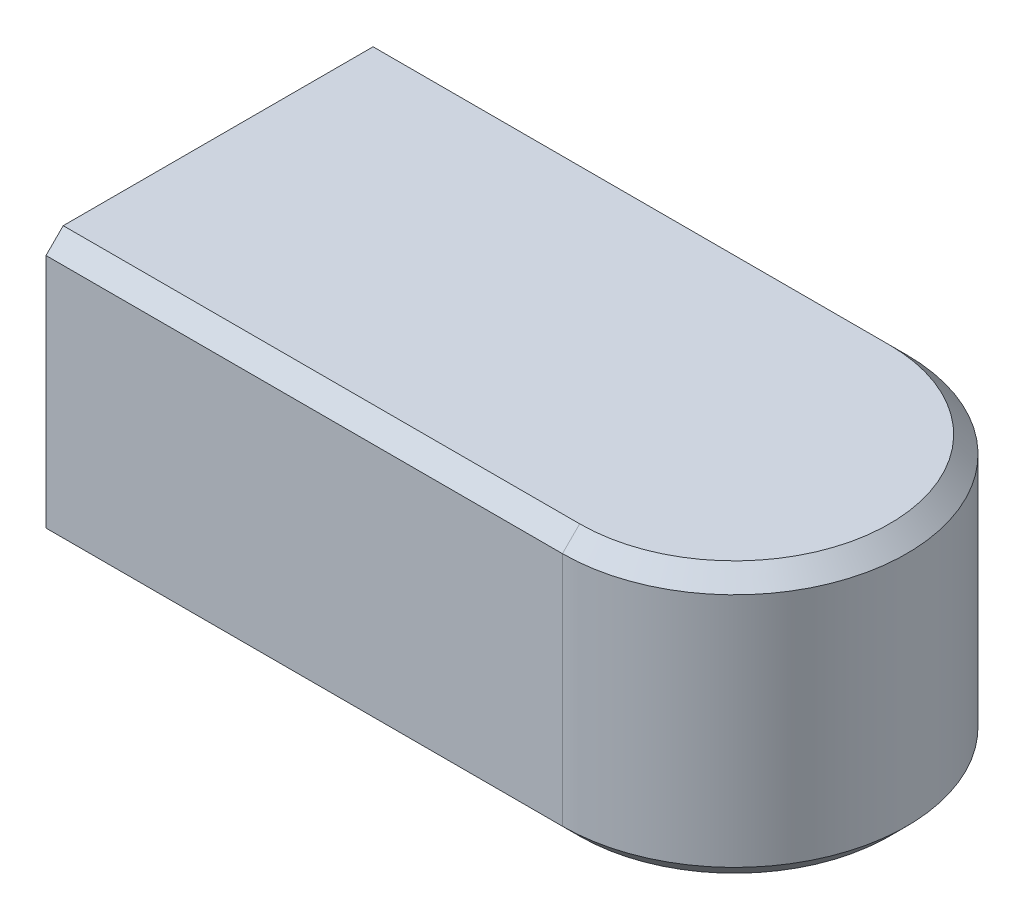
ISO-10303-21;
HEADER;
FILE_DESCRIPTION(('STEP AP214'),'2;1');
FILE_NAME('part.step','',(''),(''),'','','');
FILE_SCHEMA(('AUTOMOTIVE_DESIGN { 1 0 10303 214 1 1 1 1 }'));
ENDSEC;
DATA;
#1=APPLICATION_CONTEXT('core data for automotive mechanical design processes');
#2=APPLICATION_PROTOCOL_DEFINITION('international standard','automotive_design',2000,#1);
#3=PRODUCT_CONTEXT('',#1,'mechanical');
#4=PRODUCT('Part','Part','',(#3));
#5=PRODUCT_RELATED_PRODUCT_CATEGORY('part','',(#4));
#6=PRODUCT_DEFINITION_FORMATION('','',#4);
#7=PRODUCT_DEFINITION_CONTEXT('part definition',#1,'design');
#8=PRODUCT_DEFINITION('design','',#6,#7);
#9=PRODUCT_DEFINITION_SHAPE('','',#8);
#10=(LENGTH_UNIT() NAMED_UNIT(*) SI_UNIT(.MILLI.,.METRE.));
#11=(NAMED_UNIT(*) PLANE_ANGLE_UNIT() SI_UNIT($,.RADIAN.));
#12=(NAMED_UNIT(*) SI_UNIT($,.STERADIAN.) SOLID_ANGLE_UNIT());
#13=UNCERTAINTY_MEASURE_WITH_UNIT(LENGTH_MEASURE(1.E-05),#10,'distance_accuracy_value','');
#14=(GEOMETRIC_REPRESENTATION_CONTEXT(3) GLOBAL_UNCERTAINTY_ASSIGNED_CONTEXT((#13)) GLOBAL_UNIT_ASSIGNED_CONTEXT((#10,
#11,#12)) REPRESENTATION_CONTEXT('',''));
#15=CARTESIAN_POINT('',(0.,0.,0.));
#16=DIRECTION('',(0.,0.,1.));
#17=DIRECTION('',(1.,0.,0.));
#18=AXIS2_PLACEMENT_3D('',#15,#16,#17);
#19=CARTESIAN_POINT('',(-10.5,10.6499999999999,6.64999999999993));
#20=DIRECTION('',(0.,0.70710678118655,0.70710678118655));
#21=DIRECTION('',(0.,-0.70710678118655,0.70710678118655));
#22=AXIS2_PLACEMENT_3D('',#19,#20,#21);
#23=PLANE('',#22);
#24=DIRECTION('',(1.,0.,0.));
#25=VECTOR('',#24,1.);
#26=CARTESIAN_POINT('',(0.,11.,6.29999999999997));
#27=LINE('',#26,#25);
#28=CARTESIAN_POINT('',(-21.,11.,6.29999999999997));
#29=VERTEX_POINT('',#28);
#30=CARTESIAN_POINT('',(0.,11.0000009966028,6.30000049829438));
#31=VERTEX_POINT('',#30);
#32=EDGE_CURVE('E77',#29,#31,#27,.T.);
#33=ORIENTED_EDGE('',*,*,#32,.F.);
#34=DIRECTION('',(0.,-0.70710678118655,0.70710678118655));
#35=VECTOR('',#34,1.);
#36=CARTESIAN_POINT('',(-21.,10.6499999999999,6.64999999999993));
#37=LINE('',#36,#35);
#38=CARTESIAN_POINT('',(-21.,10.2999999999999,6.99999999999978));
#39=VERTEX_POINT('',#38);
#40=EDGE_CURVE('E160',#29,#39,#37,.T.);
#41=ORIENTED_EDGE('',*,*,#40,.T.);
#42=DIRECTION('',(1.,0.,0.));
#43=VECTOR('',#42,1.);
#44=CARTESIAN_POINT('',(-21.,10.2999999999999,6.99999999999978));
#45=LINE('',#44,#43);
#46=CARTESIAN_POINT('',(0.,10.3000002768205,7.00000027682868));
#47=VERTEX_POINT('',#46);
#48=EDGE_CURVE('E110',#47,#39,#45,.F.);
#49=ORIENTED_EDGE('',*,*,#48,.F.);
#50=DIRECTION('',(0.,0.707106669334586,-0.707106893038496));
#51=VECTOR('',#50,1.);
#52=CARTESIAN_POINT('',(-2.70866662432923E-10,-498982.542133841,499000.000000003));
#53=LINE('',#52,#51);
#54=EDGE_CURVE('E96',#31,#47,#53,.F.);
#55=ORIENTED_EDGE('',*,*,#54,.F.);
#56=EDGE_LOOP('',(#33,#41,#49,#55));
#57=FACE_BOUND('',#56,.T.);
#58=ADVANCED_FACE('F16',(#57),#23,.T.);
#59=CARTESIAN_POINT('',(0.,10.3000011072821,-1.11022302462516E-13));
#60=DIRECTION('',(0.,-1.,0.));
#61=DIRECTION('',(0.,0.,-1.));
#62=AXIS2_PLACEMENT_3D('',#59,#60,#61);
#63=CONICAL_SURFACE('',#62,7.0000011073148,0.78539832154396);
#64=DIRECTION('',(0.,0.70710678118655,0.70710678118655));
#65=VECTOR('',#64,1.);
#66=CARTESIAN_POINT('',(0.,10.6499999999999,-6.65000000000027));
#67=LINE('',#66,#65);
#68=CARTESIAN_POINT('',(0.,11.0000004983012,-6.30000049829482));
#69=VERTEX_POINT('',#68);
#70=CARTESIAN_POINT('',(0.,10.2999999999998,-7.00000000000034));
#71=VERTEX_POINT('',#70);
#72=EDGE_CURVE('E88',#69,#71,#67,.F.);
#73=ORIENTED_EDGE('',*,*,#72,.F.);
#74=CARTESIAN_POINT('',(0.,11.0000009966027,-2.22044604925031E-13));
#75=DIRECTION('',(0.,-1.,0.));
#76=DIRECTION('',(0.,0.,-1.));
#77=AXIS2_PLACEMENT_3D('',#74,#75,#76);
#78=CIRCLE('',#77,6.30000099658901);
#79=EDGE_CURVE('E19',#31,#69,#78,.F.);
#80=ORIENTED_EDGE('',*,*,#79,.F.);
#81=ORIENTED_EDGE('',*,*,#54,.T.);
#82=CARTESIAN_POINT('',(0.,10.3,0.));
#83=DIRECTION('',(0.,1.,0.));
#84=DIRECTION('',(0.,0.,1.));
#85=AXIS2_PLACEMENT_3D('',#82,#83,#84);
#86=CIRCLE('',#85,7.);
#87=EDGE_CURVE('E91',#71,#47,#86,.F.);
#88=ORIENTED_EDGE('',*,*,#87,.F.);
#89=EDGE_LOOP('',(#73,#80,#81,#88));
#90=FACE_BOUND('',#89,.T.);
#91=ADVANCED_FACE('F89',(#90),#63,.T.);
#92=CARTESIAN_POINT('',(-10.5,10.6499999999999,-6.65000000000027));
#93=DIRECTION('',(0.,0.70710678118655,-0.70710678118655));
#94=DIRECTION('',(0.,0.70710678118655,0.70710678118655));
#95=AXIS2_PLACEMENT_3D('',#92,#93,#94);
#96=PLANE('',#95);
#97=DIRECTION('',(-1.,0.,0.));
#98=VECTOR('',#97,1.);
#99=CARTESIAN_POINT('',(0.,10.2999999999998,-7.00000000000034));
#100=LINE('',#99,#98);
#101=CARTESIAN_POINT('',(-21.,10.2999999999998,-7.00000000000034));
#102=VERTEX_POINT('',#101);
#103=EDGE_CURVE('E133',#102,#71,#100,.F.);
#104=ORIENTED_EDGE('',*,*,#103,.F.);
#105=DIRECTION('',(0.,0.70710678118655,0.70710678118655));
#106=VECTOR('',#105,1.);
#107=CARTESIAN_POINT('',(-21.,10.6499999999999,-6.65000000000027));
#108=LINE('',#107,#106);
#109=CARTESIAN_POINT('',(-21.,11.,-6.30000000000008));
#110=VERTEX_POINT('',#109);
#111=EDGE_CURVE('E95',#102,#110,#108,.T.);
#112=ORIENTED_EDGE('',*,*,#111,.T.);
#113=DIRECTION('',(1.,0.,0.));
#114=VECTOR('',#113,1.);
#115=CARTESIAN_POINT('',(0.,11.,-6.30000000000008));
#116=LINE('',#115,#114);
#117=EDGE_CURVE('E84',#69,#110,#116,.F.);
#118=ORIENTED_EDGE('',*,*,#117,.F.);
#119=ORIENTED_EDGE('',*,*,#72,.T.);
#120=EDGE_LOOP('',(#104,#112,#118,#119));
#121=FACE_BOUND('',#120,.T.);
#122=ADVANCED_FACE('F98',(#121),#96,.T.);
#123=CARTESIAN_POINT('',(0.,0.,0.));
#124=DIRECTION('',(0.,1.,0.));
#125=DIRECTION('',(0.,0.,1.));
#126=AXIS2_PLACEMENT_3D('',#123,#124,#125);
#127=CYLINDRICAL_SURFACE('',#126,7.);
#128=DIRECTION('',(0.,1.,0.));
#129=VECTOR('',#128,1.);
#130=CARTESIAN_POINT('',(0.,-3.33066907387547E-13,-7.00000000000039));
#131=LINE('',#130,#129);
#132=CARTESIAN_POINT('',(0.,0.699999723170946,-7.00000027682901));
#133=VERTEX_POINT('',#132);
#134=EDGE_CURVE('E136',#71,#133,#131,.F.);
#135=ORIENTED_EDGE('',*,*,#134,.F.);
#136=ORIENTED_EDGE('',*,*,#87,.T.);
#137=DIRECTION('',(0.,1.,0.));
#138=VECTOR('',#137,1.);
#139=CARTESIAN_POINT('',(0.,-5.27355936696949E-13,6.99999999999951));
#140=LINE('',#139,#138);
#141=CARTESIAN_POINT('',(0.,0.699999446328148,7.00000055364314));
#142=VERTEX_POINT('',#141);
#143=EDGE_CURVE('E135',#142,#47,#140,.T.);
#144=ORIENTED_EDGE('',*,*,#143,.F.);
#145=CARTESIAN_POINT('',(0.,0.699998892684989,0.));
#146=DIRECTION('',(0.,1.,0.));
#147=DIRECTION('',(-1.,0.,2.47234416787478E-10));
#148=AXIS2_PLACEMENT_3D('',#145,#146,#147);
#149=CIRCLE('',#148,7.0000011073148);
#150=EDGE_CURVE('E101',#133,#142,#149,.F.);
#151=ORIENTED_EDGE('',*,*,#150,.F.);
#152=EDGE_LOOP('',(#135,#136,#144,#151));
#153=FACE_BOUND('',#152,.T.);
#154=ADVANCED_FACE('F241',(#153),#127,.T.);
#155=CARTESIAN_POINT('',(0.,-3.33066907387547E-13,-7.00000000000039));
#156=DIRECTION('',(0.,0.,-1.));
#157=DIRECTION('',(-1.,0.,0.));
#158=AXIS2_PLACEMENT_3D('',#155,#156,#157);
#159=PLANE('',#158);
#160=DIRECTION('',(0.,1.,0.));
#161=VECTOR('',#160,1.);
#162=CARTESIAN_POINT('',(-21.,-3.33066907387547E-13,-7.00000000000039));
#163=LINE('',#162,#161);
#164=CARTESIAN_POINT('',(-21.,0.699999999999562,-7.00000000000045));
#165=VERTEX_POINT('',#164);
#166=EDGE_CURVE('E129',#102,#165,#163,.F.);
#167=ORIENTED_EDGE('',*,*,#166,.F.);
#168=ORIENTED_EDGE('',*,*,#103,.T.);
#169=ORIENTED_EDGE('',*,*,#134,.T.);
#170=DIRECTION('',(1.,0.,0.));
#171=VECTOR('',#170,1.);
#172=CARTESIAN_POINT('',(-10.5,0.699999999999562,-7.00000000000045));
#173=LINE('',#172,#171);
#174=EDGE_CURVE('E122',#165,#133,#173,.T.);
#175=ORIENTED_EDGE('',*,*,#174,.F.);
#176=EDGE_LOOP('',(#167,#168,#169,#175));
#177=FACE_BOUND('',#176,.T.);
#178=ADVANCED_FACE('F212',(#177),#159,.T.);
#179=CARTESIAN_POINT('',(-21.,-5.27355936696949E-13,6.99999999999951));
#180=DIRECTION('',(0.,0.,1.));
#181=DIRECTION('',(1.,0.,0.));
#182=AXIS2_PLACEMENT_3D('',#179,#180,#181);
#183=PLANE('',#182);
#184=ORIENTED_EDGE('',*,*,#143,.T.);
#185=ORIENTED_EDGE('',*,*,#48,.T.);
#186=DIRECTION('',(0.,1.,0.));
#187=VECTOR('',#186,1.);
#188=CARTESIAN_POINT('',(-21.,-5.27355936696949E-13,6.99999999999951));
#189=LINE('',#188,#187);
#190=CARTESIAN_POINT('',(-21.,0.699999999999978,6.9999999999999));
#191=VERTEX_POINT('',#190);
#192=EDGE_CURVE('E115',#191,#39,#189,.T.);
#193=ORIENTED_EDGE('',*,*,#192,.F.);
#194=DIRECTION('',(1.,0.,0.));
#195=VECTOR('',#194,1.);
#196=CARTESIAN_POINT('',(-10.5,0.699999999999978,6.9999999999999));
#197=LINE('',#196,#195);
#198=EDGE_CURVE('E99',#142,#191,#197,.F.);
#199=ORIENTED_EDGE('',*,*,#198,.F.);
#200=EDGE_LOOP('',(#184,#185,#193,#199));
#201=FACE_BOUND('',#200,.T.);
#202=ADVANCED_FACE('F205',(#201),#183,.T.);
#203=CARTESIAN_POINT('',(0.,10.9999999999997,-3.33066907387547E-13));
#204=DIRECTION('',(0.,1.,0.));
#205=DIRECTION('',(0.,0.,1.));
#206=AXIS2_PLACEMENT_3D('',#203,#204,#205);
#207=PLANE('',#206);
#208=ORIENTED_EDGE('',*,*,#79,.T.);
#209=ORIENTED_EDGE('',*,*,#117,.T.);
#210=DIRECTION('',(0.,0.,1.));
#211=VECTOR('',#210,1.);
#212=CARTESIAN_POINT('',(-21.,10.9999999999999,-7.00000000000023));
#213=LINE('',#212,#211);
#214=EDGE_CURVE('E118',#29,#110,#213,.F.);
#215=ORIENTED_EDGE('',*,*,#214,.F.);
#216=ORIENTED_EDGE('',*,*,#32,.T.);
#217=EDGE_LOOP('',(#208,#209,#215,#216));
#218=FACE_BOUND('',#217,.T.);
#219=ADVANCED_FACE('F82',(#218),#207,.T.);
#220=CARTESIAN_POINT('',(-10.5,0.349999999999656,6.6499999999996));
#221=DIRECTION('',(0.,-0.70710678118655,0.70710678118655));
#222=DIRECTION('',(0.,-0.70710678118655,-0.70710678118655));
#223=AXIS2_PLACEMENT_3D('',#220,#221,#222);
#224=PLANE('',#223);
#225=ORIENTED_EDGE('',*,*,#198,.T.);
#226=DIRECTION('',(0.,0.70710678118655,0.707106781186551));
#227=VECTOR('',#226,1.);
#228=CARTESIAN_POINT('',(-21.,-2.22044604925031E-13,6.29999999999986));
#229=LINE('',#228,#227);
#230=CARTESIAN_POINT('',(-21.,-2.22044604925031E-13,6.29999999999986));
#231=VERTEX_POINT('',#230);
#232=EDGE_CURVE('E119',#231,#191,#229,.T.);
#233=ORIENTED_EDGE('',*,*,#232,.F.);
#234=DIRECTION('',(1.,0.,0.));
#235=VECTOR('',#234,1.);
#236=CARTESIAN_POINT('',(0.,-2.22044604925031E-13,6.29999999999986));
#237=LINE('',#236,#235);
#238=CARTESIAN_POINT('',(0.,-9.96578819467686E-07,6.30000049829449));
#239=VERTEX_POINT('',#238);
#240=EDGE_CURVE('E156',#231,#239,#237,.T.);
#241=ORIENTED_EDGE('',*,*,#240,.T.);
#242=DIRECTION('',(0.,-0.707106669334586,-0.707106893038496));
#243=VECTOR('',#242,1.);
#244=CARTESIAN_POINT('',(-4.92661467177413E-11,498993.54213384,499000.000000002));
#245=LINE('',#244,#243);
#246=EDGE_CURVE('E126',#142,#239,#245,.T.);
#247=ORIENTED_EDGE('',*,*,#246,.F.);
#248=EDGE_LOOP('',(#225,#233,#241,#247));
#249=FACE_BOUND('',#248,.T.);
#250=ADVANCED_FACE('F232',(#249),#224,.T.);
#251=CARTESIAN_POINT('',(0.,0.699998892627979,-3.33066907387547E-13));
#252=DIRECTION('',(0.,1.,0.));
#253=DIRECTION('',(0.,0.,1.));
#254=AXIS2_PLACEMENT_3D('',#251,#252,#253);
#255=CONICAL_SURFACE('',#254,7.00000110725796,0.785398321584563);
#256=ORIENTED_EDGE('',*,*,#246,.T.);
#257=CARTESIAN_POINT('',(0.,-9.96578819467686E-07,0.));
#258=DIRECTION('',(0.,1.,0.));
#259=DIRECTION('',(0.,0.,1.));
#260=AXIS2_PLACEMENT_3D('',#257,#258,#259);
#261=CIRCLE('',#260,6.30000099658901);
#262=CARTESIAN_POINT('',(0.,-4.98289770556326E-07,-6.30000049829493));
#263=VERTEX_POINT('',#262);
#264=EDGE_CURVE('E172',#239,#263,#261,.T.);
#265=ORIENTED_EDGE('',*,*,#264,.T.);
#266=DIRECTION('',(0.,0.70710678118655,-0.70710678118655));
#267=VECTOR('',#266,1.);
#268=CARTESIAN_POINT('',(0.,0.349999999999739,-6.6500000000001));
#269=LINE('',#268,#267);
#270=EDGE_CURVE('E125',#133,#263,#269,.F.);
#271=ORIENTED_EDGE('',*,*,#270,.F.);
#272=ORIENTED_EDGE('',*,*,#150,.T.);
#273=EDGE_LOOP('',(#256,#265,#271,#272));
#274=FACE_BOUND('',#273,.T.);
#275=ADVANCED_FACE('F229',(#274),#255,.T.);
#276=CARTESIAN_POINT('',(-10.5,0.349999999999739,-6.6500000000001));
#277=DIRECTION('',(0.,-0.70710678118655,-0.70710678118655));
#278=DIRECTION('',(0.,0.70710678118655,-0.70710678118655));
#279=AXIS2_PLACEMENT_3D('',#276,#277,#278);
#280=PLANE('',#279);
#281=DIRECTION('',(1.,0.,0.));
#282=VECTOR('',#281,1.);
#283=CARTESIAN_POINT('',(0.,-3.60822483003176E-13,-6.30000000000042));
#284=LINE('',#283,#282);
#285=CARTESIAN_POINT('',(-21.,-3.60822483003176E-13,-6.30000000000042));
#286=VERTEX_POINT('',#285);
#287=EDGE_CURVE('E25',#263,#286,#284,.F.);
#288=ORIENTED_EDGE('',*,*,#287,.T.);
#289=DIRECTION('',(0.,-0.70710678118655,0.70710678118655));
#290=VECTOR('',#289,1.);
#291=CARTESIAN_POINT('',(-21.,0.699999999999562,-7.00000000000045));
#292=LINE('',#291,#290);
#293=EDGE_CURVE('E33',#165,#286,#292,.T.);
#294=ORIENTED_EDGE('',*,*,#293,.F.);
#295=ORIENTED_EDGE('',*,*,#174,.T.);
#296=ORIENTED_EDGE('',*,*,#270,.T.);
#297=EDGE_LOOP('',(#288,#294,#295,#296));
#298=FACE_BOUND('',#297,.T.);
#299=ADVANCED_FACE('F215',(#298),#280,.T.);
#300=CARTESIAN_POINT('',(-21.,-3.33066907387547E-13,-7.00000000000039));
#301=DIRECTION('',(-1.,0.,0.));
#302=DIRECTION('',(0.,0.,1.));
#303=AXIS2_PLACEMENT_3D('',#300,#301,#302);
#304=PLANE('',#303);
#305=ORIENTED_EDGE('',*,*,#214,.T.);
#306=ORIENTED_EDGE('',*,*,#111,.F.);
#307=ORIENTED_EDGE('',*,*,#166,.T.);
#308=ORIENTED_EDGE('',*,*,#293,.T.);
#309=DIRECTION('',(0.,0.,1.));
#310=VECTOR('',#309,1.);
#311=CARTESIAN_POINT('',(-21.,0.,0.));
#312=LINE('',#311,#310);
#313=EDGE_CURVE('E11',#286,#231,#312,.T.);
#314=ORIENTED_EDGE('',*,*,#313,.T.);
#315=ORIENTED_EDGE('',*,*,#232,.T.);
#316=ORIENTED_EDGE('',*,*,#192,.T.);
#317=ORIENTED_EDGE('',*,*,#40,.F.);
#318=EDGE_LOOP('',(#305,#306,#307,#308,#314,#315,#316,#317));
#319=FACE_BOUND('',#318,.T.);
#320=ADVANCED_FACE('F202',(#319),#304,.T.);
#321=CARTESIAN_POINT('',(0.,0.,0.));
#322=DIRECTION('',(0.,1.,0.));
#323=DIRECTION('',(0.,0.,1.));
#324=AXIS2_PLACEMENT_3D('',#321,#322,#323);
#325=PLANE('',#324);
#326=ORIENTED_EDGE('',*,*,#287,.F.);
#327=ORIENTED_EDGE('',*,*,#264,.F.);
#328=ORIENTED_EDGE('',*,*,#240,.F.);
#329=ORIENTED_EDGE('',*,*,#313,.F.);
#330=EDGE_LOOP('',(#326,#327,#328,#329));
#331=FACE_BOUND('',#330,.T.);
#332=ADVANCED_FACE('F218',(#331),#325,.F.);
#333=CLOSED_SHELL('',(#58,#91,#122,#154,#178,#202,#219,#250,#275,#299,#320,#332));
#334=MANIFOLD_SOLID_BREP('B1',#333);
#335=ADVANCED_BREP_SHAPE_REPRESENTATION('',(#18,#334),#14);
#336=SHAPE_DEFINITION_REPRESENTATION(#9,#335);
ENDSEC;
END-ISO-10303-21;
